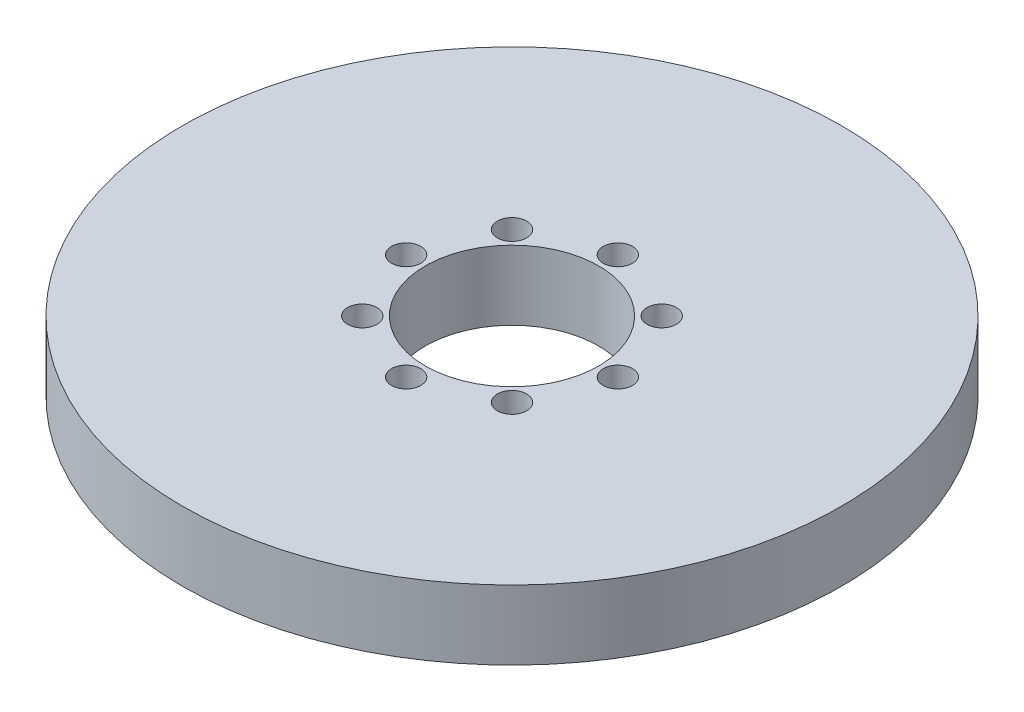
ISO-10303-21;
HEADER;
FILE_DESCRIPTION(('STEP AP214'),'2;1');
FILE_NAME('part.step','',(''),(''),'','','');
FILE_SCHEMA(('AUTOMOTIVE_DESIGN { 1 0 10303 214 1 1 1 1 }'));
ENDSEC;
DATA;
#1=APPLICATION_CONTEXT('core data for automotive mechanical design processes');
#2=APPLICATION_PROTOCOL_DEFINITION('international standard','automotive_design',2000,#1);
#3=PRODUCT_CONTEXT('',#1,'mechanical');
#4=PRODUCT('Part','Part','',(#3));
#5=PRODUCT_RELATED_PRODUCT_CATEGORY('part','',(#4));
#6=PRODUCT_DEFINITION_FORMATION('','',#4);
#7=PRODUCT_DEFINITION_CONTEXT('part definition',#1,'design');
#8=PRODUCT_DEFINITION('design','',#6,#7);
#9=PRODUCT_DEFINITION_SHAPE('','',#8);
#10=(LENGTH_UNIT() NAMED_UNIT(*) SI_UNIT(.MILLI.,.METRE.));
#11=(NAMED_UNIT(*) PLANE_ANGLE_UNIT() SI_UNIT($,.RADIAN.));
#12=(NAMED_UNIT(*) SI_UNIT($,.STERADIAN.) SOLID_ANGLE_UNIT());
#13=UNCERTAINTY_MEASURE_WITH_UNIT(LENGTH_MEASURE(1.E-05),#10,'distance_accuracy_value','');
#14=(GEOMETRIC_REPRESENTATION_CONTEXT(3) GLOBAL_UNCERTAINTY_ASSIGNED_CONTEXT((#13)) GLOBAL_UNIT_ASSIGNED_CONTEXT((#10,
#11,#12)) REPRESENTATION_CONTEXT('',''));
#15=CARTESIAN_POINT('',(0.,0.,0.));
#16=DIRECTION('',(0.,0.,1.));
#17=DIRECTION('',(1.,0.,0.));
#18=AXIS2_PLACEMENT_3D('',#15,#16,#17);
#19=CARTESIAN_POINT('',(0.,10.,0.));
#20=DIRECTION('',(0.,-1.,0.));
#21=DIRECTION('',(0.,0.,-1.));
#22=AXIS2_PLACEMENT_3D('',#19,#20,#21);
#23=CYLINDRICAL_SURFACE('',#22,47.5);
#24=CARTESIAN_POINT('',(0.,10.,0.));
#25=DIRECTION('',(0.,1.,0.));
#26=DIRECTION('',(0.,0.,1.));
#27=AXIS2_PLACEMENT_3D('',#24,#25,#26);
#28=CIRCLE('',#27,47.5);
#29=CARTESIAN_POINT('',(0.,10.,47.5));
#30=VERTEX_POINT('',#29);
#31=EDGE_CURVE('E10',#30,#30,#28,.T.);
#32=ORIENTED_EDGE('',*,*,#31,.F.);
#33=EDGE_LOOP('',(#32));
#34=FACE_BOUND('',#33,.T.);
#35=CARTESIAN_POINT('',(0.,0.,0.));
#36=DIRECTION('',(0.,1.,0.));
#37=DIRECTION('',(0.,0.,1.));
#38=AXIS2_PLACEMENT_3D('',#35,#36,#37);
#39=CIRCLE('',#38,47.5);
#40=CARTESIAN_POINT('',(0.,0.,47.5));
#41=VERTEX_POINT('',#40);
#42=EDGE_CURVE('E37',#41,#41,#39,.T.);
#43=ORIENTED_EDGE('',*,*,#42,.T.);
#44=EDGE_LOOP('',(#43));
#45=FACE_BOUND('',#44,.T.);
#46=ADVANCED_FACE('F40',(#34,#45),#23,.T.);
#47=CARTESIAN_POINT('',(0.,10.,0.));
#48=DIRECTION('',(0.,1.,0.));
#49=DIRECTION('',(0.,0.,1.));
#50=AXIS2_PLACEMENT_3D('',#47,#48,#49);
#51=PLANE('',#50);
#52=CARTESIAN_POINT('',(0.,10.,15.2596693593007));
#53=DIRECTION('',(0.,1.,0.));
#54=DIRECTION('',(1.,0.,0.));
#55=AXIS2_PLACEMENT_3D('',#52,#53,#54);
#56=CIRCLE('',#55,2.11003069237935);
#57=CARTESIAN_POINT('',(2.11003069237941,10.,15.2596693593006));
#58=VERTEX_POINT('',#57);
#59=EDGE_CURVE('E88',#58,#58,#56,.T.);
#60=ORIENTED_EDGE('',*,*,#59,.F.);
#61=EDGE_LOOP('',(#60));
#62=FACE_BOUND('',#61,.T.);
#63=CARTESIAN_POINT('',(10.7902156826261,10.,10.790215682626));
#64=DIRECTION('',(0.,1.,0.));
#65=DIRECTION('',(0.707106781186544,0.,-0.707106781186551));
#66=AXIS2_PLACEMENT_3D('',#63,#64,#65);
#67=CIRCLE('',#66,2.11003069237935);
#68=CARTESIAN_POINT('',(12.2822326937193,10.,9.29819867153282));
#69=VERTEX_POINT('',#68);
#70=EDGE_CURVE('E79',#69,#69,#67,.T.);
#71=ORIENTED_EDGE('',*,*,#70,.F.);
#72=EDGE_LOOP('',(#71));
#73=FACE_BOUND('',#72,.T.);
#74=CARTESIAN_POINT('',(15.2596693593007,10.,0.));
#75=DIRECTION('',(0.,1.,0.));
#76=DIRECTION('',(0.,0.,-1.));
#77=AXIS2_PLACEMENT_3D('',#74,#75,#76);
#78=CIRCLE('',#77,2.11003069237935);
#79=CARTESIAN_POINT('',(15.2596693593007,10.,-2.11003069237935));
#80=VERTEX_POINT('',#79);
#81=EDGE_CURVE('E74',#80,#80,#78,.T.);
#82=ORIENTED_EDGE('',*,*,#81,.F.);
#83=EDGE_LOOP('',(#82));
#84=FACE_BOUND('',#83,.T.);
#85=CARTESIAN_POINT('',(10.790215682626,10.,-10.7902156826262));
#86=DIRECTION('',(0.,1.,0.));
#87=DIRECTION('',(-0.707106781186554,0.,-0.707106781186541));
#88=AXIS2_PLACEMENT_3D('',#85,#86,#87);
#89=CIRCLE('',#88,2.11003069237935);
#90=CARTESIAN_POINT('',(9.29819867153278,10.,-12.2822326937193));
#91=VERTEX_POINT('',#90);
#92=EDGE_CURVE('E70',#91,#91,#89,.T.);
#93=ORIENTED_EDGE('',*,*,#92,.F.);
#94=EDGE_LOOP('',(#93));
#95=FACE_BOUND('',#94,.T.);
#96=CARTESIAN_POINT('',(-1.59836552414744E-13,10.,-15.2596693593007));
#97=DIRECTION('',(0.,1.,0.));
#98=DIRECTION('',(-1.,0.,0.));
#99=AXIS2_PLACEMENT_3D('',#96,#97,#98);
#100=CIRCLE('',#99,2.11003069237935);
#101=CARTESIAN_POINT('',(-2.11003069237951,10.,-15.2596693593006));
#102=VERTEX_POINT('',#101);
#103=EDGE_CURVE('E100',#102,#102,#100,.T.);
#104=ORIENTED_EDGE('',*,*,#103,.F.);
#105=EDGE_LOOP('',(#104));
#106=FACE_BOUND('',#105,.T.);
#107=CARTESIAN_POINT('',(-10.7902156826262,10.,-10.7902156826259));
#108=DIRECTION('',(0.,1.,0.));
#109=DIRECTION('',(-0.707106781186539,0.,0.707106781186556));
#110=AXIS2_PLACEMENT_3D('',#107,#108,#109);
#111=CIRCLE('',#110,2.11003069237935);
#112=CARTESIAN_POINT('',(-12.2822326937194,10.,-9.29819867153273));
#113=VERTEX_POINT('',#112);
#114=EDGE_CURVE('E93',#113,#113,#111,.T.);
#115=ORIENTED_EDGE('',*,*,#114,.F.);
#116=EDGE_LOOP('',(#115));
#117=FACE_BOUND('',#116,.T.);
#118=CARTESIAN_POINT('',(-10.7902156826261,10.,10.7902156826261));
#119=DIRECTION('',(0.,1.,0.));
#120=DIRECTION('',(0.707106781186549,0.,0.707106781186546));
#121=AXIS2_PLACEMENT_3D('',#118,#119,#120);
#122=CIRCLE('',#121,2.11003069237935);
#123=CARTESIAN_POINT('',(-9.29819867153286,10.,12.2822326937193));
#124=VERTEX_POINT('',#123);
#125=EDGE_CURVE('E61',#124,#124,#122,.T.);
#126=ORIENTED_EDGE('',*,*,#125,.F.);
#127=EDGE_LOOP('',(#126));
#128=FACE_BOUND('',#127,.T.);
#129=CARTESIAN_POINT('',(-15.2596693593007,10.,0.));
#130=DIRECTION('',(0.,1.,0.));
#131=DIRECTION('',(0.,0.,1.));
#132=AXIS2_PLACEMENT_3D('',#129,#130,#131);
#133=CIRCLE('',#132,2.11003069237935);
#134=CARTESIAN_POINT('',(-15.2596693593007,10.,2.11003069237935));
#135=VERTEX_POINT('',#134);
#136=EDGE_CURVE('E54',#135,#135,#133,.T.);
#137=ORIENTED_EDGE('',*,*,#136,.F.);
#138=EDGE_LOOP('',(#137));
#139=FACE_BOUND('',#138,.T.);
#140=CARTESIAN_POINT('',(0.,10.,0.));
#141=DIRECTION('',(0.,1.,0.));
#142=DIRECTION('',(0.,0.,1.));
#143=AXIS2_PLACEMENT_3D('',#140,#141,#142);
#144=CIRCLE('',#143,12.5);
#145=CARTESIAN_POINT('',(0.,10.,12.5));
#146=VERTEX_POINT('',#145);
#147=EDGE_CURVE('E50',#146,#146,#144,.T.);
#148=ORIENTED_EDGE('',*,*,#147,.F.);
#149=EDGE_LOOP('',(#148));
#150=FACE_BOUND('',#149,.T.);
#151=ORIENTED_EDGE('',*,*,#31,.T.);
#152=EDGE_LOOP('',(#151));
#153=FACE_BOUND('',#152,.T.);
#154=ADVANCED_FACE('F115',(#62,#73,#84,#95,#106,#117,#128,#139,#150,#153),#51,.T.);
#155=CARTESIAN_POINT('',(0.,0.,0.));
#156=DIRECTION('',(0.,1.,0.));
#157=DIRECTION('',(0.,0.,1.));
#158=AXIS2_PLACEMENT_3D('',#155,#156,#157);
#159=PLANE('',#158);
#160=CARTESIAN_POINT('',(0.,0.,0.));
#161=DIRECTION('',(0.,1.,0.));
#162=DIRECTION('',(0.,0.,1.));
#163=AXIS2_PLACEMENT_3D('',#160,#161,#162);
#164=CIRCLE('',#163,12.5);
#165=CARTESIAN_POINT('',(0.,0.,12.5));
#166=VERTEX_POINT('',#165);
#167=EDGE_CURVE('E47',#166,#166,#164,.T.);
#168=ORIENTED_EDGE('',*,*,#167,.T.);
#169=EDGE_LOOP('',(#168));
#170=FACE_BOUND('',#169,.T.);
#171=ORIENTED_EDGE('',*,*,#42,.F.);
#172=EDGE_LOOP('',(#171));
#173=FACE_BOUND('',#172,.T.);
#174=ADVANCED_FACE('F113',(#170,#173),#159,.F.);
#175=CARTESIAN_POINT('',(0.,10.,0.));
#176=DIRECTION('',(0.,-1.,0.));
#177=DIRECTION('',(0.,0.,-1.));
#178=AXIS2_PLACEMENT_3D('',#175,#176,#177);
#179=CYLINDRICAL_SURFACE('',#178,12.5);
#180=ORIENTED_EDGE('',*,*,#147,.T.);
#181=EDGE_LOOP('',(#180));
#182=FACE_BOUND('',#181,.T.);
#183=ORIENTED_EDGE('',*,*,#167,.F.);
#184=EDGE_LOOP('',(#183));
#185=FACE_BOUND('',#184,.T.);
#186=ADVANCED_FACE('F127',(#182,#185),#179,.F.);
#187=CARTESIAN_POINT('',(-15.2596693593007,2.8243484565221,0.));
#188=DIRECTION('',(0.,1.,0.));
#189=DIRECTION('',(0.,0.,1.));
#190=AXIS2_PLACEMENT_3D('',#187,#188,#189);
#191=CYLINDRICAL_SURFACE('',#190,2.11003069237935);
#192=CARTESIAN_POINT('',(-15.2596693593007,2.8243484565221,0.));
#193=DIRECTION('',(0.,1.,0.));
#194=DIRECTION('',(0.,0.,1.));
#195=AXIS2_PLACEMENT_3D('',#192,#193,#194);
#196=CIRCLE('',#195,2.11003069237935);
#197=CARTESIAN_POINT('',(-15.2596693593007,2.8243484565221,2.11003069237935));
#198=VERTEX_POINT('',#197);
#199=EDGE_CURVE('E55',#198,#198,#196,.T.);
#200=ORIENTED_EDGE('',*,*,#199,.F.);
#201=EDGE_LOOP('',(#200));
#202=FACE_BOUND('',#201,.T.);
#203=ORIENTED_EDGE('',*,*,#136,.T.);
#204=EDGE_LOOP('',(#203));
#205=FACE_BOUND('',#204,.T.);
#206=ADVANCED_FACE('F129',(#202,#205),#191,.F.);
#207=CARTESIAN_POINT('',(-15.2596693593007,2.8243484565221,0.));
#208=DIRECTION('',(0.,1.,0.));
#209=DIRECTION('',(0.,0.,1.));
#210=AXIS2_PLACEMENT_3D('',#207,#208,#209);
#211=PLANE('',#210);
#212=ORIENTED_EDGE('',*,*,#199,.T.);
#213=EDGE_LOOP('',(#212));
#214=FACE_BOUND('',#213,.T.);
#215=ADVANCED_FACE('F157',(#214),#211,.T.);
#216=CARTESIAN_POINT('',(-10.7902156826261,2.8243484565221,10.7902156826261));
#217=DIRECTION('',(0.,1.,0.));
#218=DIRECTION('',(0.,0.,1.));
#219=AXIS2_PLACEMENT_3D('',#216,#217,#218);
#220=CYLINDRICAL_SURFACE('',#219,2.11003069237935);
#221=CARTESIAN_POINT('',(-10.7902156826261,2.8243484565221,10.7902156826261));
#222=DIRECTION('',(0.,1.,0.));
#223=DIRECTION('',(0.707106781186549,0.,0.707106781186546));
#224=AXIS2_PLACEMENT_3D('',#221,#222,#223);
#225=CIRCLE('',#224,2.11003069237935);
#226=CARTESIAN_POINT('',(-9.29819867153286,2.8243484565221,12.2822326937193));
#227=VERTEX_POINT('',#226);
#228=EDGE_CURVE('E59',#227,#227,#225,.T.);
#229=ORIENTED_EDGE('',*,*,#228,.F.);
#230=EDGE_LOOP('',(#229));
#231=FACE_BOUND('',#230,.T.);
#232=ORIENTED_EDGE('',*,*,#125,.T.);
#233=EDGE_LOOP('',(#232));
#234=FACE_BOUND('',#233,.T.);
#235=ADVANCED_FACE('F170',(#231,#234),#220,.F.);
#236=CARTESIAN_POINT('',(-10.7902156826261,2.8243484565221,10.7902156826261));
#237=DIRECTION('',(0.,1.,0.));
#238=DIRECTION('',(0.707106781186549,0.,0.707106781186546));
#239=AXIS2_PLACEMENT_3D('',#236,#237,#238);
#240=PLANE('',#239);
#241=ORIENTED_EDGE('',*,*,#228,.T.);
#242=EDGE_LOOP('',(#241));
#243=FACE_BOUND('',#242,.T.);
#244=ADVANCED_FACE('F182',(#243),#240,.T.);
#245=CARTESIAN_POINT('',(-10.7902156826262,2.8243484565221,-10.7902156826259));
#246=DIRECTION('',(0.,1.,0.));
#247=DIRECTION('',(0.,0.,1.));
#248=AXIS2_PLACEMENT_3D('',#245,#246,#247);
#249=CYLINDRICAL_SURFACE('',#248,2.11003069237935);
#250=CARTESIAN_POINT('',(-10.7902156826262,2.8243484565221,-10.7902156826259));
#251=DIRECTION('',(0.,1.,0.));
#252=DIRECTION('',(-0.707106781186539,0.,0.707106781186556));
#253=AXIS2_PLACEMENT_3D('',#250,#251,#252);
#254=CIRCLE('',#253,2.11003069237935);
#255=CARTESIAN_POINT('',(-12.2822326937194,2.8243484565221,-9.29819867153273));
#256=VERTEX_POINT('',#255);
#257=EDGE_CURVE('E94',#256,#256,#254,.T.);
#258=ORIENTED_EDGE('',*,*,#257,.F.);
#259=EDGE_LOOP('',(#258));
#260=FACE_BOUND('',#259,.T.);
#261=ORIENTED_EDGE('',*,*,#114,.T.);
#262=EDGE_LOOP('',(#261));
#263=FACE_BOUND('',#262,.T.);
#264=ADVANCED_FACE('F189',(#260,#263),#249,.F.);
#265=CARTESIAN_POINT('',(-10.7902156826262,2.8243484565221,-10.7902156826259));
#266=DIRECTION('',(0.,1.,0.));
#267=DIRECTION('',(-0.707106781186539,0.,0.707106781186556));
#268=AXIS2_PLACEMENT_3D('',#265,#266,#267);
#269=PLANE('',#268);
#270=ORIENTED_EDGE('',*,*,#257,.T.);
#271=EDGE_LOOP('',(#270));
#272=FACE_BOUND('',#271,.T.);
#273=ADVANCED_FACE('F107',(#272),#269,.T.);
#274=CARTESIAN_POINT('',(-1.59836552414744E-13,2.8243484565221,-15.2596693593007));
#275=DIRECTION('',(0.,1.,0.));
#276=DIRECTION('',(0.,0.,1.));
#277=AXIS2_PLACEMENT_3D('',#274,#275,#276);
#278=CYLINDRICAL_SURFACE('',#277,2.11003069237935);
#279=CARTESIAN_POINT('',(-1.59836552414744E-13,2.8243484565221,-15.2596693593007));
#280=DIRECTION('',(0.,1.,0.));
#281=DIRECTION('',(-1.,0.,0.));
#282=AXIS2_PLACEMENT_3D('',#279,#280,#281);
#283=CIRCLE('',#282,2.11003069237935);
#284=CARTESIAN_POINT('',(-2.11003069237951,2.8243484565221,-15.2596693593006));
#285=VERTEX_POINT('',#284);
#286=EDGE_CURVE('E72',#285,#285,#283,.T.);
#287=ORIENTED_EDGE('',*,*,#286,.F.);
#288=EDGE_LOOP('',(#287));
#289=FACE_BOUND('',#288,.T.);
#290=ORIENTED_EDGE('',*,*,#103,.T.);
#291=EDGE_LOOP('',(#290));
#292=FACE_BOUND('',#291,.T.);
#293=ADVANCED_FACE('F104',(#289,#292),#278,.F.);
#294=CARTESIAN_POINT('',(-1.59836552414744E-13,2.8243484565221,-15.2596693593007));
#295=DIRECTION('',(0.,1.,0.));
#296=DIRECTION('',(-1.,0.,0.));
#297=AXIS2_PLACEMENT_3D('',#294,#295,#296);
#298=PLANE('',#297);
#299=ORIENTED_EDGE('',*,*,#286,.T.);
#300=EDGE_LOOP('',(#299));
#301=FACE_BOUND('',#300,.T.);
#302=ADVANCED_FACE('F103',(#301),#298,.T.);
#303=CARTESIAN_POINT('',(10.790215682626,2.8243484565221,-10.7902156826262));
#304=DIRECTION('',(0.,1.,0.));
#305=DIRECTION('',(0.,0.,1.));
#306=AXIS2_PLACEMENT_3D('',#303,#304,#305);
#307=CYLINDRICAL_SURFACE('',#306,2.11003069237935);
#308=CARTESIAN_POINT('',(10.790215682626,2.8243484565221,-10.7902156826262));
#309=DIRECTION('',(0.,1.,0.));
#310=DIRECTION('',(-0.707106781186554,0.,-0.707106781186541));
#311=AXIS2_PLACEMENT_3D('',#308,#309,#310);
#312=CIRCLE('',#311,2.11003069237935);
#313=CARTESIAN_POINT('',(9.29819867153278,2.8243484565221,-12.2822326937193));
#314=VERTEX_POINT('',#313);
#315=EDGE_CURVE('E69',#314,#314,#312,.T.);
#316=ORIENTED_EDGE('',*,*,#315,.F.);
#317=EDGE_LOOP('',(#316));
#318=FACE_BOUND('',#317,.T.);
#319=ORIENTED_EDGE('',*,*,#92,.T.);
#320=EDGE_LOOP('',(#319));
#321=FACE_BOUND('',#320,.T.);
#322=ADVANCED_FACE('F219',(#318,#321),#307,.F.);
#323=CARTESIAN_POINT('',(10.790215682626,2.8243484565221,-10.7902156826262));
#324=DIRECTION('',(0.,1.,0.));
#325=DIRECTION('',(-0.707106781186554,0.,-0.707106781186541));
#326=AXIS2_PLACEMENT_3D('',#323,#324,#325);
#327=PLANE('',#326);
#328=ORIENTED_EDGE('',*,*,#315,.T.);
#329=EDGE_LOOP('',(#328));
#330=FACE_BOUND('',#329,.T.);
#331=ADVANCED_FACE('F227',(#330),#327,.T.);
#332=CARTESIAN_POINT('',(15.2596693593007,2.8243484565221,0.));
#333=DIRECTION('',(0.,1.,0.));
#334=DIRECTION('',(0.,0.,1.));
#335=AXIS2_PLACEMENT_3D('',#332,#333,#334);
#336=CYLINDRICAL_SURFACE('',#335,2.11003069237935);
#337=CARTESIAN_POINT('',(15.2596693593007,2.8243484565221,0.));
#338=DIRECTION('',(0.,1.,0.));
#339=DIRECTION('',(0.,0.,-1.));
#340=AXIS2_PLACEMENT_3D('',#337,#338,#339);
#341=CIRCLE('',#340,2.11003069237935);
#342=CARTESIAN_POINT('',(15.2596693593007,2.8243484565221,-2.11003069237935));
#343=VERTEX_POINT('',#342);
#344=EDGE_CURVE('E80',#343,#343,#341,.T.);
#345=ORIENTED_EDGE('',*,*,#344,.F.);
#346=EDGE_LOOP('',(#345));
#347=FACE_BOUND('',#346,.T.);
#348=ORIENTED_EDGE('',*,*,#81,.T.);
#349=EDGE_LOOP('',(#348));
#350=FACE_BOUND('',#349,.T.);
#351=ADVANCED_FACE('F240',(#347,#350),#336,.F.);
#352=CARTESIAN_POINT('',(15.2596693593007,2.8243484565221,0.));
#353=DIRECTION('',(0.,1.,0.));
#354=DIRECTION('',(0.,0.,-1.));
#355=AXIS2_PLACEMENT_3D('',#352,#353,#354);
#356=PLANE('',#355);
#357=ORIENTED_EDGE('',*,*,#344,.T.);
#358=EDGE_LOOP('',(#357));
#359=FACE_BOUND('',#358,.T.);
#360=ADVANCED_FACE('F246',(#359),#356,.T.);
#361=CARTESIAN_POINT('',(10.7902156826261,2.8243484565221,10.790215682626));
#362=DIRECTION('',(0.,1.,0.));
#363=DIRECTION('',(0.,0.,1.));
#364=AXIS2_PLACEMENT_3D('',#361,#362,#363);
#365=CYLINDRICAL_SURFACE('',#364,2.11003069237935);
#366=CARTESIAN_POINT('',(10.7902156826261,2.8243484565221,10.790215682626));
#367=DIRECTION('',(0.,1.,0.));
#368=DIRECTION('',(0.707106781186544,0.,-0.707106781186551));
#369=AXIS2_PLACEMENT_3D('',#366,#367,#368);
#370=CIRCLE('',#369,2.11003069237935);
#371=CARTESIAN_POINT('',(12.2822326937193,2.8243484565221,9.29819867153282));
#372=VERTEX_POINT('',#371);
#373=EDGE_CURVE('E82',#372,#372,#370,.T.);
#374=ORIENTED_EDGE('',*,*,#373,.F.);
#375=EDGE_LOOP('',(#374));
#376=FACE_BOUND('',#375,.T.);
#377=ORIENTED_EDGE('',*,*,#70,.T.);
#378=EDGE_LOOP('',(#377));
#379=FACE_BOUND('',#378,.T.);
#380=ADVANCED_FACE('F254',(#376,#379),#365,.F.);
#381=CARTESIAN_POINT('',(10.7902156826261,2.8243484565221,10.790215682626));
#382=DIRECTION('',(0.,1.,0.));
#383=DIRECTION('',(0.707106781186544,0.,-0.707106781186551));
#384=AXIS2_PLACEMENT_3D('',#381,#382,#383);
#385=PLANE('',#384);
#386=ORIENTED_EDGE('',*,*,#373,.T.);
#387=EDGE_LOOP('',(#386));
#388=FACE_BOUND('',#387,.T.);
#389=ADVANCED_FACE('F262',(#388),#385,.T.);
#390=CARTESIAN_POINT('',(0.,2.8243484565221,15.2596693593007));
#391=DIRECTION('',(0.,1.,0.));
#392=DIRECTION('',(0.,0.,1.));
#393=AXIS2_PLACEMENT_3D('',#390,#391,#392);
#394=CYLINDRICAL_SURFACE('',#393,2.11003069237935);
#395=CARTESIAN_POINT('',(0.,2.8243484565221,15.2596693593007));
#396=DIRECTION('',(0.,1.,0.));
#397=DIRECTION('',(1.,0.,0.));
#398=AXIS2_PLACEMENT_3D('',#395,#396,#397);
#399=CIRCLE('',#398,2.11003069237935);
#400=CARTESIAN_POINT('',(2.11003069237941,2.8243484565221,15.2596693593006));
#401=VERTEX_POINT('',#400);
#402=EDGE_CURVE('E63',#401,#401,#399,.T.);
#403=ORIENTED_EDGE('',*,*,#402,.F.);
#404=EDGE_LOOP('',(#403));
#405=FACE_BOUND('',#404,.T.);
#406=ORIENTED_EDGE('',*,*,#59,.T.);
#407=EDGE_LOOP('',(#406));
#408=FACE_BOUND('',#407,.T.);
#409=ADVANCED_FACE('F272',(#405,#408),#394,.F.);
#410=CARTESIAN_POINT('',(0.,2.8243484565221,15.2596693593007));
#411=DIRECTION('',(0.,1.,0.));
#412=DIRECTION('',(1.,0.,0.));
#413=AXIS2_PLACEMENT_3D('',#410,#411,#412);
#414=PLANE('',#413);
#415=ORIENTED_EDGE('',*,*,#402,.T.);
#416=EDGE_LOOP('',(#415));
#417=FACE_BOUND('',#416,.T.);
#418=ADVANCED_FACE('F285',(#417),#414,.T.);
#419=CLOSED_SHELL('',(#46,#154,#174,#186,#206,#215,#235,#244,#264,#273,#293,#302,#322,#331,#351,
#360,#380,#389,#409,#418));
#420=MANIFOLD_SOLID_BREP('B2',#419);
#421=ADVANCED_BREP_SHAPE_REPRESENTATION('',(#18,#420),#14);
#422=SHAPE_DEFINITION_REPRESENTATION(#9,#421);
ENDSEC;
END-ISO-10303-21;
